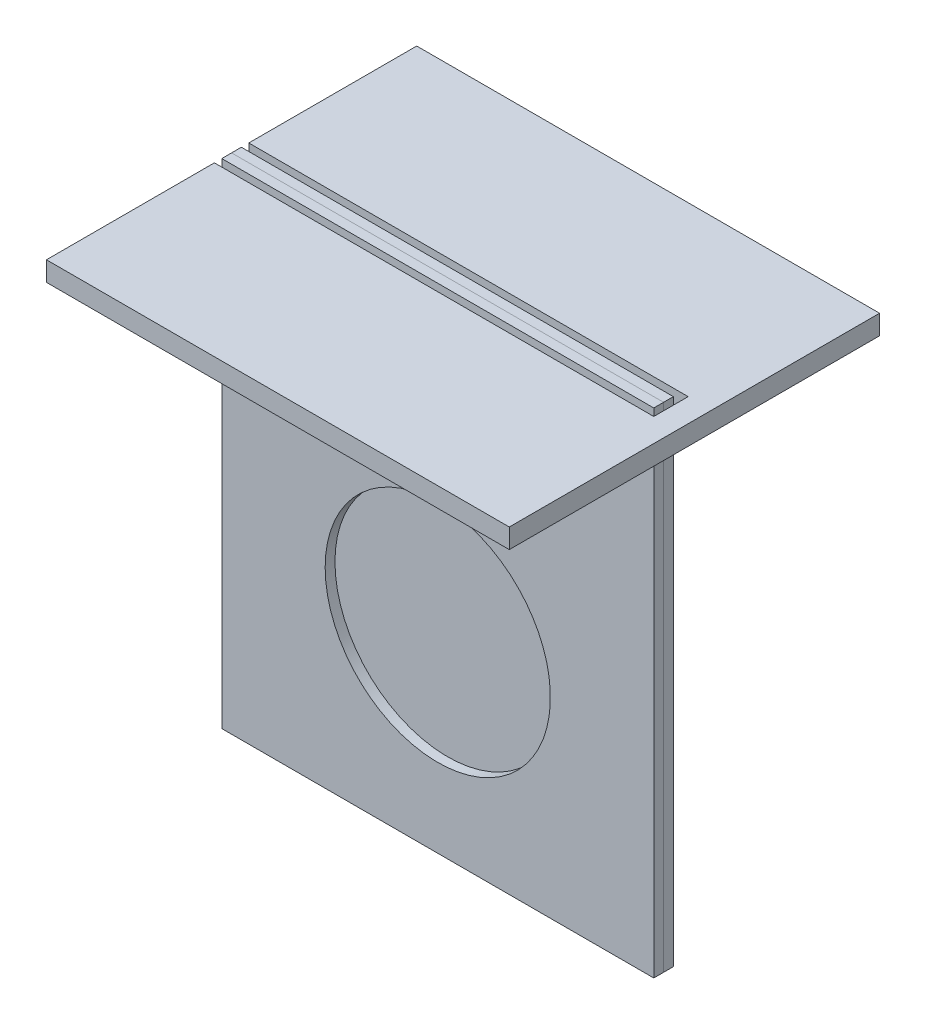
ISO-10303-21;
HEADER;
FILE_DESCRIPTION(('STEP AP214'),'2;1');
FILE_NAME('part.step','',(''),(''),'','','');
FILE_SCHEMA(('AUTOMOTIVE_DESIGN { 1 0 10303 214 1 1 1 1 }'));
ENDSEC;
DATA;
#1=APPLICATION_CONTEXT('core data for automotive mechanical design processes');
#2=APPLICATION_PROTOCOL_DEFINITION('international standard','automotive_design',2000,#1);
#3=PRODUCT_CONTEXT('',#1,'mechanical');
#4=PRODUCT('Part','Part','',(#3));
#5=PRODUCT_RELATED_PRODUCT_CATEGORY('part','',(#4));
#6=PRODUCT_DEFINITION_FORMATION('','',#4);
#7=PRODUCT_DEFINITION_CONTEXT('part definition',#1,'design');
#8=PRODUCT_DEFINITION('design','',#6,#7);
#9=PRODUCT_DEFINITION_SHAPE('','',#8);
#10=(LENGTH_UNIT() NAMED_UNIT(*) SI_UNIT(.MILLI.,.METRE.));
#11=(NAMED_UNIT(*) PLANE_ANGLE_UNIT() SI_UNIT($,.RADIAN.));
#12=(NAMED_UNIT(*) SI_UNIT($,.STERADIAN.) SOLID_ANGLE_UNIT());
#13=UNCERTAINTY_MEASURE_WITH_UNIT(LENGTH_MEASURE(1.E-05),#10,'distance_accuracy_value','');
#14=(GEOMETRIC_REPRESENTATION_CONTEXT(3) GLOBAL_UNCERTAINTY_ASSIGNED_CONTEXT((#13)) GLOBAL_UNIT_ASSIGNED_CONTEXT((#10,
#11,#12)) REPRESENTATION_CONTEXT('',''));
#15=CARTESIAN_POINT('',(0.,0.,0.));
#16=DIRECTION('',(0.,0.,1.));
#17=DIRECTION('',(1.,0.,0.));
#18=AXIS2_PLACEMENT_3D('',#15,#16,#17);
#19=CARTESIAN_POINT('',(-0.79375,45.825,-1.5875));
#20=DIRECTION('',(0.,-1.,0.));
#21=DIRECTION('',(0.,0.,1.));
#22=AXIS2_PLACEMENT_3D('',#19,#20,#21);
#23=PLANE('',#22);
#24=DIRECTION('',(0.,0.,1.));
#25=VECTOR('',#24,1.);
#26=CARTESIAN_POINT('',(0.79375,45.825,-1.5875));
#27=LINE('',#26,#25);
#28=CARTESIAN_POINT('',(0.79375,45.825,-30.));
#29=VERTEX_POINT('',#28);
#30=CARTESIAN_POINT('',(0.79375,45.825,-1.5875));
#31=VERTEX_POINT('',#30);
#32=EDGE_CURVE('E104',#29,#31,#27,.T.);
#33=ORIENTED_EDGE('',*,*,#32,.F.);
#34=DIRECTION('',(1.,0.,0.));
#35=VECTOR('',#34,1.);
#36=CARTESIAN_POINT('',(-0.79375,45.825,-30.));
#37=LINE('',#36,#35);
#38=CARTESIAN_POINT('',(-0.79375,45.825,-30.));
#39=VERTEX_POINT('',#38);
#40=EDGE_CURVE('E99',#39,#29,#37,.T.);
#41=ORIENTED_EDGE('',*,*,#40,.F.);
#42=DIRECTION('',(0.,0.,1.));
#43=VECTOR('',#42,1.);
#44=CARTESIAN_POINT('',(-0.79375,45.825,-1.5875));
#45=LINE('',#44,#43);
#46=CARTESIAN_POINT('',(-0.79375,45.825,-1.5875));
#47=VERTEX_POINT('',#46);
#48=EDGE_CURVE('E91',#39,#47,#45,.T.);
#49=ORIENTED_EDGE('',*,*,#48,.T.);
#50=DIRECTION('',(1.,0.,0.));
#51=VECTOR('',#50,1.);
#52=CARTESIAN_POINT('',(-0.79375,45.825,-1.5875));
#53=LINE('',#52,#51);
#54=EDGE_CURVE('E12',#47,#31,#53,.T.);
#55=ORIENTED_EDGE('',*,*,#54,.T.);
#56=EDGE_LOOP('',(#33,#41,#49,#55));
#57=FACE_BOUND('',#56,.T.);
#58=ADVANCED_FACE('F52',(#57),#23,.F.);
#59=CARTESIAN_POINT('',(-0.79375,16.9341740766103,-1.5875));
#60=DIRECTION('',(0.,0.,-1.));
#61=DIRECTION('',(0.,-1.,0.));
#62=AXIS2_PLACEMENT_3D('',#59,#60,#61);
#63=PLANE('',#62);
#64=DIRECTION('',(0.,-1.,0.));
#65=VECTOR('',#64,1.);
#66=CARTESIAN_POINT('',(0.79375,16.9341740766103,-1.5875));
#67=LINE('',#66,#65);
#68=CARTESIAN_POINT('',(0.79375,16.9341740766103,-1.5875));
#69=VERTEX_POINT('',#68);
#70=EDGE_CURVE('E96',#31,#69,#67,.T.);
#71=ORIENTED_EDGE('',*,*,#70,.F.);
#72=ORIENTED_EDGE('',*,*,#54,.F.);
#73=DIRECTION('',(0.,-1.,0.));
#74=VECTOR('',#73,1.);
#75=CARTESIAN_POINT('',(-0.79375,16.9341740766103,-1.5875));
#76=LINE('',#75,#74);
#77=CARTESIAN_POINT('',(-0.79375,16.9341740766103,-1.5875));
#78=VERTEX_POINT('',#77);
#79=EDGE_CURVE('E87',#47,#78,#76,.T.);
#80=ORIENTED_EDGE('',*,*,#79,.T.);
#81=DIRECTION('',(1.,0.,0.));
#82=VECTOR('',#81,1.);
#83=CARTESIAN_POINT('',(-0.79375,16.9341740766103,-1.5875));
#84=LINE('',#83,#82);
#85=EDGE_CURVE('E60',#78,#69,#84,.T.);
#86=ORIENTED_EDGE('',*,*,#85,.T.);
#87=EDGE_LOOP('',(#71,#72,#80,#86));
#88=FACE_BOUND('',#87,.T.);
#89=ADVANCED_FACE('F95',(#88),#63,.F.);
#90=CARTESIAN_POINT('',(-0.79375,45.825,-30.));
#91=DIRECTION('',(0.,0.701179947463391,0.712984348548575));
#92=DIRECTION('',(0.,0.712984348548575,-0.701179947463391));
#93=AXIS2_PLACEMENT_3D('',#90,#91,#92);
#94=PLANE('',#93);
#95=DIRECTION('',(0.,0.712984348548575,-0.701179947463391));
#96=VECTOR('',#95,1.);
#97=CARTESIAN_POINT('',(0.79375,45.825,-30.));
#98=LINE('',#97,#96);
#99=EDGE_CURVE('E79',#69,#29,#98,.T.);
#100=ORIENTED_EDGE('',*,*,#99,.F.);
#101=ORIENTED_EDGE('',*,*,#85,.F.);
#102=DIRECTION('',(0.,0.712984348548575,-0.701179947463391));
#103=VECTOR('',#102,1.);
#104=CARTESIAN_POINT('',(-0.79375,45.825,-30.));
#105=LINE('',#104,#103);
#106=EDGE_CURVE('E68',#78,#39,#105,.T.);
#107=ORIENTED_EDGE('',*,*,#106,.T.);
#108=ORIENTED_EDGE('',*,*,#40,.T.);
#109=EDGE_LOOP('',(#100,#101,#107,#108));
#110=FACE_BOUND('',#109,.T.);
#111=ADVANCED_FACE('F113',(#110),#94,.F.);
#112=CARTESIAN_POINT('',(-0.79375,0.,0.));
#113=DIRECTION('',(-1.,0.,0.));
#114=DIRECTION('',(0.,0.,-1.));
#115=AXIS2_PLACEMENT_3D('',#112,#113,#114);
#116=PLANE('',#115);
#117=ORIENTED_EDGE('',*,*,#48,.F.);
#118=ORIENTED_EDGE('',*,*,#106,.F.);
#119=ORIENTED_EDGE('',*,*,#79,.F.);
#120=EDGE_LOOP('',(#117,#118,#119));
#121=FACE_BOUND('',#120,.T.);
#122=ADVANCED_FACE('F89',(#121),#116,.T.);
#123=CARTESIAN_POINT('',(0.79375,0.,0.));
#124=DIRECTION('',(-1.,0.,0.));
#125=DIRECTION('',(0.,0.,-1.));
#126=AXIS2_PLACEMENT_3D('',#123,#124,#125);
#127=PLANE('',#126);
#128=ORIENTED_EDGE('',*,*,#32,.T.);
#129=ORIENTED_EDGE('',*,*,#70,.T.);
#130=ORIENTED_EDGE('',*,*,#99,.T.);
#131=EDGE_LOOP('',(#128,#129,#130));
#132=FACE_BOUND('',#131,.T.);
#133=ADVANCED_FACE('F107',(#132),#127,.F.);
#134=CLOSED_SHELL('',(#58,#89,#111,#122,#133));
#135=MANIFOLD_SOLID_BREP('B2',#134);
#136=CARTESIAN_POINT('',(-35.,45.825,-30.));
#137=DIRECTION('',(1.,0.,0.));
#138=DIRECTION('',(0.,0.,1.));
#139=AXIS2_PLACEMENT_3D('',#136,#137,#138);
#140=PLANE('',#139);
#141=DIRECTION('',(0.,0.,1.));
#142=VECTOR('',#141,1.);
#143=CARTESIAN_POINT('',(-35.,49.,-30.));
#144=LINE('',#143,#142);
#145=CARTESIAN_POINT('',(-35.,49.,-30.));
#146=VERTEX_POINT('',#145);
#147=CARTESIAN_POINT('',(-35.,49.,-2.7875));
#148=VERTEX_POINT('',#147);
#149=EDGE_CURVE('E266',#146,#148,#144,.T.);
#150=ORIENTED_EDGE('',*,*,#149,.F.);
#151=DIRECTION('',(0.,1.,0.));
#152=VECTOR('',#151,1.);
#153=CARTESIAN_POINT('',(-35.,45.825,-30.));
#154=LINE('',#153,#152);
#155=CARTESIAN_POINT('',(-35.,45.825,-30.));
#156=VERTEX_POINT('',#155);
#157=EDGE_CURVE('E265',#156,#146,#154,.T.);
#158=ORIENTED_EDGE('',*,*,#157,.F.);
#159=DIRECTION('',(0.,0.,1.));
#160=VECTOR('',#159,1.);
#161=CARTESIAN_POINT('',(-35.,45.825,-30.));
#162=LINE('',#161,#160);
#163=CARTESIAN_POINT('',(-35.,45.825,-2.7875));
#164=VERTEX_POINT('',#163);
#165=EDGE_CURVE('E284',#156,#164,#162,.T.);
#166=ORIENTED_EDGE('',*,*,#165,.T.);
#167=DIRECTION('',(0.,1.,0.));
#168=VECTOR('',#167,1.);
#169=CARTESIAN_POINT('',(-35.,45.825,-2.7875));
#170=LINE('',#169,#168);
#171=EDGE_CURVE('E50',#164,#148,#170,.T.);
#172=ORIENTED_EDGE('',*,*,#171,.T.);
#173=EDGE_LOOP('',(#150,#158,#166,#172));
#174=FACE_BOUND('',#173,.T.);
#175=ADVANCED_FACE('F170',(#174),#140,.F.);
#176=CARTESIAN_POINT('',(-35.,45.825,-2.7875));
#177=DIRECTION('',(0.,0.,-1.));
#178=DIRECTION('',(0.,-1.,0.));
#179=AXIS2_PLACEMENT_3D('',#176,#177,#178);
#180=PLANE('',#179);
#181=DIRECTION('',(1.,0.,0.));
#182=VECTOR('',#181,1.);
#183=CARTESIAN_POINT('',(-35.,49.,-2.7875));
#184=LINE('',#183,#182);
#185=CARTESIAN_POINT('',(36.2,49.,-2.7875));
#186=VERTEX_POINT('',#185);
#187=EDGE_CURVE('E268',#148,#186,#184,.T.);
#188=ORIENTED_EDGE('',*,*,#187,.F.);
#189=ORIENTED_EDGE('',*,*,#171,.F.);
#190=DIRECTION('',(1.,0.,0.));
#191=VECTOR('',#190,1.);
#192=CARTESIAN_POINT('',(-35.,45.825,-2.7875));
#193=LINE('',#192,#191);
#194=CARTESIAN_POINT('',(36.2,45.825,-2.7875));
#195=VERTEX_POINT('',#194);
#196=EDGE_CURVE('E224',#164,#195,#193,.T.);
#197=ORIENTED_EDGE('',*,*,#196,.T.);
#198=DIRECTION('',(0.,1.,0.));
#199=VECTOR('',#198,1.);
#200=CARTESIAN_POINT('',(36.2,45.825,-2.7875));
#201=LINE('',#200,#199);
#202=EDGE_CURVE('E178',#195,#186,#201,.T.);
#203=ORIENTED_EDGE('',*,*,#202,.T.);
#204=EDGE_LOOP('',(#188,#189,#197,#203));
#205=FACE_BOUND('',#204,.T.);
#206=ADVANCED_FACE('F296',(#205),#180,.F.);
#207=CARTESIAN_POINT('',(36.2,45.825,0.));
#208=DIRECTION('',(1.,0.,0.));
#209=DIRECTION('',(0.,1.,0.));
#210=AXIS2_PLACEMENT_3D('',#207,#208,#209);
#211=PLANE('',#210);
#212=DIRECTION('',(0.,0.,1.));
#213=VECTOR('',#212,1.);
#214=CARTESIAN_POINT('',(36.2,49.,0.));
#215=LINE('',#214,#213);
#216=CARTESIAN_POINT('',(36.2,49.,2.7875));
#217=VERTEX_POINT('',#216);
#218=EDGE_CURVE('E271',#186,#217,#215,.T.);
#219=ORIENTED_EDGE('',*,*,#218,.F.);
#220=ORIENTED_EDGE('',*,*,#202,.F.);
#221=DIRECTION('',(0.,0.,1.));
#222=VECTOR('',#221,1.);
#223=CARTESIAN_POINT('',(36.2,45.825,-2.7875));
#224=LINE('',#223,#222);
#225=CARTESIAN_POINT('',(36.2,45.825,2.7875));
#226=VERTEX_POINT('',#225);
#227=EDGE_CURVE('E305',#195,#226,#224,.T.);
#228=ORIENTED_EDGE('',*,*,#227,.T.);
#229=DIRECTION('',(0.,1.,0.));
#230=VECTOR('',#229,1.);
#231=CARTESIAN_POINT('',(36.2,45.825,2.7875));
#232=LINE('',#231,#230);
#233=EDGE_CURVE('E291',#226,#217,#232,.T.);
#234=ORIENTED_EDGE('',*,*,#233,.T.);
#235=EDGE_LOOP('',(#219,#220,#228,#234));
#236=FACE_BOUND('',#235,.T.);
#237=ADVANCED_FACE('F315',(#236),#211,.F.);
#238=CARTESIAN_POINT('',(36.2,45.825,2.7875));
#239=DIRECTION('',(0.,0.,1.));
#240=DIRECTION('',(0.,1.,0.));
#241=AXIS2_PLACEMENT_3D('',#238,#239,#240);
#242=PLANE('',#241);
#243=DIRECTION('',(-1.,0.,0.));
#244=VECTOR('',#243,1.);
#245=CARTESIAN_POINT('',(36.2,49.,2.7875));
#246=LINE('',#245,#244);
#247=CARTESIAN_POINT('',(-35.,49.,2.7875));
#248=VERTEX_POINT('',#247);
#249=EDGE_CURVE('E274',#217,#248,#246,.T.);
#250=ORIENTED_EDGE('',*,*,#249,.F.);
#251=ORIENTED_EDGE('',*,*,#233,.F.);
#252=DIRECTION('',(-1.,0.,0.));
#253=VECTOR('',#252,1.);
#254=CARTESIAN_POINT('',(36.2,45.825,2.7875));
#255=LINE('',#254,#253);
#256=CARTESIAN_POINT('',(-35.,45.825,2.7875));
#257=VERTEX_POINT('',#256);
#258=EDGE_CURVE('E260',#226,#257,#255,.T.);
#259=ORIENTED_EDGE('',*,*,#258,.T.);
#260=DIRECTION('',(0.,1.,0.));
#261=VECTOR('',#260,1.);
#262=CARTESIAN_POINT('',(-35.,45.825,2.7875));
#263=LINE('',#262,#261);
#264=EDGE_CURVE('E288',#257,#248,#263,.T.);
#265=ORIENTED_EDGE('',*,*,#264,.T.);
#266=EDGE_LOOP('',(#250,#251,#259,#265));
#267=FACE_BOUND('',#266,.T.);
#268=ADVANCED_FACE('F311',(#267),#242,.F.);
#269=CARTESIAN_POINT('',(-35.,45.825,2.7875));
#270=DIRECTION('',(1.,0.,0.));
#271=DIRECTION('',(0.,0.,1.));
#272=AXIS2_PLACEMENT_3D('',#269,#270,#271);
#273=PLANE('',#272);
#274=DIRECTION('',(0.,0.,1.));
#275=VECTOR('',#274,1.);
#276=CARTESIAN_POINT('',(-35.,49.,2.7875));
#277=LINE('',#276,#275);
#278=CARTESIAN_POINT('',(-35.,49.,30.));
#279=VERTEX_POINT('',#278);
#280=EDGE_CURVE('E277',#248,#279,#277,.T.);
#281=ORIENTED_EDGE('',*,*,#280,.F.);
#282=ORIENTED_EDGE('',*,*,#264,.F.);
#283=DIRECTION('',(0.,0.,1.));
#284=VECTOR('',#283,1.);
#285=CARTESIAN_POINT('',(-35.,45.825,2.7875));
#286=LINE('',#285,#284);
#287=CARTESIAN_POINT('',(-35.,45.825,30.));
#288=VERTEX_POINT('',#287);
#289=EDGE_CURVE('E258',#257,#288,#286,.T.);
#290=ORIENTED_EDGE('',*,*,#289,.T.);
#291=DIRECTION('',(0.,1.,0.));
#292=VECTOR('',#291,1.);
#293=CARTESIAN_POINT('',(-35.,45.825,30.));
#294=LINE('',#293,#292);
#295=EDGE_CURVE('E252',#288,#279,#294,.T.);
#296=ORIENTED_EDGE('',*,*,#295,.T.);
#297=EDGE_LOOP('',(#281,#282,#290,#296));
#298=FACE_BOUND('',#297,.T.);
#299=ADVANCED_FACE('F314',(#298),#273,.F.);
#300=CARTESIAN_POINT('',(-35.,45.825,30.));
#301=DIRECTION('',(0.,0.,-1.));
#302=DIRECTION('',(1.,0.,0.));
#303=AXIS2_PLACEMENT_3D('',#300,#301,#302);
#304=PLANE('',#303);
#305=DIRECTION('',(1.,0.,0.));
#306=VECTOR('',#305,1.);
#307=CARTESIAN_POINT('',(-35.,49.,30.));
#308=LINE('',#307,#306);
#309=CARTESIAN_POINT('',(40.,49.,30.));
#310=VERTEX_POINT('',#309);
#311=EDGE_CURVE('E280',#279,#310,#308,.T.);
#312=ORIENTED_EDGE('',*,*,#311,.F.);
#313=ORIENTED_EDGE('',*,*,#295,.F.);
#314=DIRECTION('',(1.,0.,0.));
#315=VECTOR('',#314,1.);
#316=CARTESIAN_POINT('',(-35.,45.825,30.));
#317=LINE('',#316,#315);
#318=CARTESIAN_POINT('',(40.,45.825,30.));
#319=VERTEX_POINT('',#318);
#320=EDGE_CURVE('E242',#288,#319,#317,.T.);
#321=ORIENTED_EDGE('',*,*,#320,.T.);
#322=DIRECTION('',(0.,1.,0.));
#323=VECTOR('',#322,1.);
#324=CARTESIAN_POINT('',(40.,45.825,30.));
#325=LINE('',#324,#323);
#326=EDGE_CURVE('E247',#319,#310,#325,.T.);
#327=ORIENTED_EDGE('',*,*,#326,.T.);
#328=EDGE_LOOP('',(#312,#313,#321,#327));
#329=FACE_BOUND('',#328,.T.);
#330=ADVANCED_FACE('F255',(#329),#304,.F.);
#331=CARTESIAN_POINT('',(40.,45.825,-30.));
#332=DIRECTION('',(-1.,0.,0.));
#333=DIRECTION('',(0.,-1.,0.));
#334=AXIS2_PLACEMENT_3D('',#331,#332,#333);
#335=PLANE('',#334);
#336=DIRECTION('',(0.,0.,-1.));
#337=VECTOR('',#336,1.);
#338=CARTESIAN_POINT('',(40.,49.,-30.));
#339=LINE('',#338,#337);
#340=CARTESIAN_POINT('',(40.,49.,-30.));
#341=VERTEX_POINT('',#340);
#342=EDGE_CURVE('E249',#310,#341,#339,.T.);
#343=ORIENTED_EDGE('',*,*,#342,.F.);
#344=ORIENTED_EDGE('',*,*,#326,.F.);
#345=DIRECTION('',(0.,0.,-1.));
#346=VECTOR('',#345,1.);
#347=CARTESIAN_POINT('',(40.,45.825,-30.));
#348=LINE('',#347,#346);
#349=CARTESIAN_POINT('',(40.,45.825,-30.));
#350=VERTEX_POINT('',#349);
#351=EDGE_CURVE('E238',#319,#350,#348,.T.);
#352=ORIENTED_EDGE('',*,*,#351,.T.);
#353=DIRECTION('',(0.,1.,0.));
#354=VECTOR('',#353,1.);
#355=CARTESIAN_POINT('',(40.,45.825,-30.));
#356=LINE('',#355,#354);
#357=EDGE_CURVE('E253',#350,#341,#356,.T.);
#358=ORIENTED_EDGE('',*,*,#357,.T.);
#359=EDGE_LOOP('',(#343,#344,#352,#358));
#360=FACE_BOUND('',#359,.T.);
#361=ADVANCED_FACE('F248',(#360),#335,.F.);
#362=CARTESIAN_POINT('',(-35.,45.825,-30.));
#363=DIRECTION('',(0.,0.,1.));
#364=DIRECTION('',(-1.,0.,0.));
#365=AXIS2_PLACEMENT_3D('',#362,#363,#364);
#366=PLANE('',#365);
#367=DIRECTION('',(-1.,0.,0.));
#368=VECTOR('',#367,1.);
#369=CARTESIAN_POINT('',(-35.,49.,-30.));
#370=LINE('',#369,#368);
#371=EDGE_CURVE('E212',#341,#146,#370,.T.);
#372=ORIENTED_EDGE('',*,*,#371,.F.);
#373=ORIENTED_EDGE('',*,*,#357,.F.);
#374=DIRECTION('',(-1.,0.,0.));
#375=VECTOR('',#374,1.);
#376=CARTESIAN_POINT('',(-35.,45.825,-30.));
#377=LINE('',#376,#375);
#378=EDGE_CURVE('E186',#350,#156,#377,.T.);
#379=ORIENTED_EDGE('',*,*,#378,.T.);
#380=ORIENTED_EDGE('',*,*,#157,.T.);
#381=EDGE_LOOP('',(#372,#373,#379,#380));
#382=FACE_BOUND('',#381,.T.);
#383=ADVANCED_FACE('F370',(#382),#366,.F.);
#384=CARTESIAN_POINT('',(0.,45.825,0.));
#385=DIRECTION('',(0.,-1.,0.));
#386=DIRECTION('',(0.,0.,1.));
#387=AXIS2_PLACEMENT_3D('',#384,#385,#386);
#388=PLANE('',#387);
#389=ORIENTED_EDGE('',*,*,#165,.F.);
#390=ORIENTED_EDGE('',*,*,#378,.F.);
#391=ORIENTED_EDGE('',*,*,#351,.F.);
#392=ORIENTED_EDGE('',*,*,#320,.F.);
#393=ORIENTED_EDGE('',*,*,#289,.F.);
#394=ORIENTED_EDGE('',*,*,#258,.F.);
#395=ORIENTED_EDGE('',*,*,#227,.F.);
#396=ORIENTED_EDGE('',*,*,#196,.F.);
#397=EDGE_LOOP('',(#389,#390,#391,#392,#393,#394,#395,#396));
#398=FACE_BOUND('',#397,.T.);
#399=ADVANCED_FACE('F240',(#398),#388,.T.);
#400=CARTESIAN_POINT('',(0.,49.,0.));
#401=DIRECTION('',(0.,-1.,0.));
#402=DIRECTION('',(0.,0.,1.));
#403=AXIS2_PLACEMENT_3D('',#400,#401,#402);
#404=PLANE('',#403);
#405=ORIENTED_EDGE('',*,*,#149,.T.);
#406=ORIENTED_EDGE('',*,*,#187,.T.);
#407=ORIENTED_EDGE('',*,*,#218,.T.);
#408=ORIENTED_EDGE('',*,*,#249,.T.);
#409=ORIENTED_EDGE('',*,*,#280,.T.);
#410=ORIENTED_EDGE('',*,*,#311,.T.);
#411=ORIENTED_EDGE('',*,*,#342,.T.);
#412=ORIENTED_EDGE('',*,*,#371,.T.);
#413=EDGE_LOOP('',(#405,#406,#407,#408,#409,#410,#411,#412));
#414=FACE_BOUND('',#413,.T.);
#415=ADVANCED_FACE('F299',(#414),#404,.F.);
#416=CLOSED_SHELL('',(#175,#206,#237,#268,#299,#330,#361,#383,#399,#415));
#417=MANIFOLD_SOLID_BREP('B6',#416);
#418=CARTESIAN_POINT('',(0.,0.,1.5875));
#419=DIRECTION('',(0.,0.,1.));
#420=DIRECTION('',(-1.,0.,0.));
#421=AXIS2_PLACEMENT_3D('',#418,#419,#420);
#422=PLANE('',#421);
#423=DIRECTION('',(1.,0.,0.));
#424=VECTOR('',#423,1.);
#425=CARTESIAN_POINT('',(-35.,49.,1.5875));
#426=LINE('',#425,#424);
#427=CARTESIAN_POINT('',(-35.,49.,1.5875));
#428=VERTEX_POINT('',#427);
#429=CARTESIAN_POINT('',(35.,49.,1.5875));
#430=VERTEX_POINT('',#429);
#431=EDGE_CURVE('E486',#428,#430,#426,.T.);
#432=ORIENTED_EDGE('',*,*,#431,.F.);
#433=DIRECTION('',(0.,1.,0.));
#434=VECTOR('',#433,1.);
#435=CARTESIAN_POINT('',(-35.,-31.,1.5875));
#436=LINE('',#435,#434);
#437=CARTESIAN_POINT('',(-35.,-31.,1.5875));
#438=VERTEX_POINT('',#437);
#439=EDGE_CURVE('E489',#438,#428,#436,.T.);
#440=ORIENTED_EDGE('',*,*,#439,.F.);
#441=DIRECTION('',(-1.,0.,0.));
#442=VECTOR('',#441,1.);
#443=CARTESIAN_POINT('',(35.,-31.,1.5875));
#444=LINE('',#443,#442);
#445=CARTESIAN_POINT('',(35.,-31.,1.5875));
#446=VERTEX_POINT('',#445);
#447=EDGE_CURVE('E477',#446,#438,#444,.T.);
#448=ORIENTED_EDGE('',*,*,#447,.F.);
#449=DIRECTION('',(0.,-1.,0.));
#450=VECTOR('',#449,1.);
#451=CARTESIAN_POINT('',(35.,49.,1.5875));
#452=LINE('',#451,#450);
#453=EDGE_CURVE('E482',#430,#446,#452,.T.);
#454=ORIENTED_EDGE('',*,*,#453,.F.);
#455=EDGE_LOOP('',(#432,#440,#448,#454));
#456=FACE_BOUND('',#455,.T.);
#457=CARTESIAN_POINT('',(0.,0.,1.5875));
#458=DIRECTION('',(0.,0.,-1.));
#459=DIRECTION('',(-1.,0.,0.));
#460=AXIS2_PLACEMENT_3D('',#457,#458,#459);
#461=CIRCLE('',#460,18.2500000000008);
#462=CARTESIAN_POINT('',(-18.2500000000008,0.,1.5875));
#463=VERTEX_POINT('',#462);
#464=EDGE_CURVE('E498',#463,#463,#461,.T.);
#465=ORIENTED_EDGE('',*,*,#464,.T.);
#466=EDGE_LOOP('',(#465));
#467=FACE_BOUND('',#466,.T.);
#468=ADVANCED_FACE('F430',(#456,#467),#422,.T.);
#469=CARTESIAN_POINT('',(0.,0.,0.));
#470=DIRECTION('',(0.,0.,1.));
#471=DIRECTION('',(-1.,0.,0.));
#472=AXIS2_PLACEMENT_3D('',#469,#470,#471);
#473=PLANE('',#472);
#474=DIRECTION('',(1.,0.,0.));
#475=VECTOR('',#474,1.);
#476=CARTESIAN_POINT('',(-35.,49.,0.));
#477=LINE('',#476,#475);
#478=CARTESIAN_POINT('',(-35.,49.,0.));
#479=VERTEX_POINT('',#478);
#480=CARTESIAN_POINT('',(35.,49.,0.));
#481=VERTEX_POINT('',#480);
#482=EDGE_CURVE('E494',#479,#481,#477,.T.);
#483=ORIENTED_EDGE('',*,*,#482,.T.);
#484=DIRECTION('',(0.,-1.,0.));
#485=VECTOR('',#484,1.);
#486=CARTESIAN_POINT('',(35.,49.,0.));
#487=LINE('',#486,#485);
#488=CARTESIAN_POINT('',(35.,-31.,0.));
#489=VERTEX_POINT('',#488);
#490=EDGE_CURVE('E497',#481,#489,#487,.T.);
#491=ORIENTED_EDGE('',*,*,#490,.T.);
#492=DIRECTION('',(-1.,0.,0.));
#493=VECTOR('',#492,1.);
#494=CARTESIAN_POINT('',(35.,-31.,0.));
#495=LINE('',#494,#493);
#496=CARTESIAN_POINT('',(-35.,-31.,0.));
#497=VERTEX_POINT('',#496);
#498=EDGE_CURVE('E480',#489,#497,#495,.T.);
#499=ORIENTED_EDGE('',*,*,#498,.T.);
#500=DIRECTION('',(0.,1.,0.));
#501=VECTOR('',#500,1.);
#502=CARTESIAN_POINT('',(-35.,-31.,0.));
#503=LINE('',#502,#501);
#504=EDGE_CURVE('E501',#497,#479,#503,.T.);
#505=ORIENTED_EDGE('',*,*,#504,.T.);
#506=EDGE_LOOP('',(#483,#491,#499,#505));
#507=FACE_BOUND('',#506,.T.);
#508=CARTESIAN_POINT('',(0.,0.,0.));
#509=DIRECTION('',(0.,0.,-1.));
#510=DIRECTION('',(-1.,0.,0.));
#511=AXIS2_PLACEMENT_3D('',#508,#509,#510);
#512=CIRCLE('',#511,18.2500000000008);
#513=CARTESIAN_POINT('',(-18.2500000000008,0.,0.));
#514=VERTEX_POINT('',#513);
#515=EDGE_CURVE('E506',#514,#514,#512,.T.);
#516=ORIENTED_EDGE('',*,*,#515,.F.);
#517=EDGE_LOOP('',(#516));
#518=FACE_BOUND('',#517,.T.);
#519=ADVANCED_FACE('F519',(#507,#518),#473,.F.);
#520=CARTESIAN_POINT('',(-35.,49.,1.5875));
#521=DIRECTION('',(0.,-1.,0.));
#522=DIRECTION('',(0.,0.,1.));
#523=AXIS2_PLACEMENT_3D('',#520,#521,#522);
#524=PLANE('',#523);
#525=ORIENTED_EDGE('',*,*,#482,.F.);
#526=DIRECTION('',(0.,0.,-1.));
#527=VECTOR('',#526,1.);
#528=CARTESIAN_POINT('',(-35.,49.,1.5875));
#529=LINE('',#528,#527);
#530=EDGE_CURVE('E447',#428,#479,#529,.T.);
#531=ORIENTED_EDGE('',*,*,#530,.F.);
#532=ORIENTED_EDGE('',*,*,#431,.T.);
#533=DIRECTION('',(0.,0.,-1.));
#534=VECTOR('',#533,1.);
#535=CARTESIAN_POINT('',(35.,49.,1.5875));
#536=LINE('',#535,#534);
#537=EDGE_CURVE('E168',#430,#481,#536,.T.);
#538=ORIENTED_EDGE('',*,*,#537,.T.);
#539=EDGE_LOOP('',(#525,#531,#532,#538));
#540=FACE_BOUND('',#539,.T.);
#541=ADVANCED_FACE('F432',(#540),#524,.F.);
#542=CARTESIAN_POINT('',(35.,49.,1.5875));
#543=DIRECTION('',(-1.,0.,0.));
#544=DIRECTION('',(0.,-1.,0.));
#545=AXIS2_PLACEMENT_3D('',#542,#543,#544);
#546=PLANE('',#545);
#547=ORIENTED_EDGE('',*,*,#490,.F.);
#548=ORIENTED_EDGE('',*,*,#537,.F.);
#549=ORIENTED_EDGE('',*,*,#453,.T.);
#550=DIRECTION('',(0.,0.,-1.));
#551=VECTOR('',#550,1.);
#552=CARTESIAN_POINT('',(35.,-31.,1.5875));
#553=LINE('',#552,#551);
#554=EDGE_CURVE('E439',#446,#489,#553,.T.);
#555=ORIENTED_EDGE('',*,*,#554,.T.);
#556=EDGE_LOOP('',(#547,#548,#549,#555));
#557=FACE_BOUND('',#556,.T.);
#558=ADVANCED_FACE('F483',(#557),#546,.F.);
#559=CARTESIAN_POINT('',(35.,-31.,1.5875));
#560=DIRECTION('',(0.,1.,0.));
#561=DIRECTION('',(0.,0.,-1.));
#562=AXIS2_PLACEMENT_3D('',#559,#560,#561);
#563=PLANE('',#562);
#564=ORIENTED_EDGE('',*,*,#498,.F.);
#565=ORIENTED_EDGE('',*,*,#554,.F.);
#566=ORIENTED_EDGE('',*,*,#447,.T.);
#567=DIRECTION('',(0.,0.,-1.));
#568=VECTOR('',#567,1.);
#569=CARTESIAN_POINT('',(-35.,-31.,1.5875));
#570=LINE('',#569,#568);
#571=EDGE_CURVE('E463',#438,#497,#570,.T.);
#572=ORIENTED_EDGE('',*,*,#571,.T.);
#573=EDGE_LOOP('',(#564,#565,#566,#572));
#574=FACE_BOUND('',#573,.T.);
#575=ADVANCED_FACE('F475',(#574),#563,.F.);
#576=CARTESIAN_POINT('',(-35.,-31.,1.5875));
#577=DIRECTION('',(1.,0.,0.));
#578=DIRECTION('',(0.,1.,0.));
#579=AXIS2_PLACEMENT_3D('',#576,#577,#578);
#580=PLANE('',#579);
#581=ORIENTED_EDGE('',*,*,#504,.F.);
#582=ORIENTED_EDGE('',*,*,#571,.F.);
#583=ORIENTED_EDGE('',*,*,#439,.T.);
#584=ORIENTED_EDGE('',*,*,#530,.T.);
#585=EDGE_LOOP('',(#581,#582,#583,#584));
#586=FACE_BOUND('',#585,.T.);
#587=ADVANCED_FACE('F515',(#586),#580,.F.);
#588=CARTESIAN_POINT('',(0.,0.,1.5875));
#589=DIRECTION('',(0.,0.,-1.));
#590=DIRECTION('',(1.,0.,0.));
#591=AXIS2_PLACEMENT_3D('',#588,#589,#590);
#592=CYLINDRICAL_SURFACE('',#591,18.2500000000008);
#593=ORIENTED_EDGE('',*,*,#464,.F.);
#594=EDGE_LOOP('',(#593));
#595=FACE_BOUND('',#594,.T.);
#596=ORIENTED_EDGE('',*,*,#515,.T.);
#597=EDGE_LOOP('',(#596));
#598=FACE_BOUND('',#597,.T.);
#599=ADVANCED_FACE('F512',(#595,#598),#592,.F.);
#600=CLOSED_SHELL('',(#468,#519,#541,#558,#575,#587,#599));
#601=MANIFOLD_SOLID_BREP('B44',#600);
#602=CARTESIAN_POINT('',(35.,-31.,-1.5875));
#603=DIRECTION('',(-1.,0.,0.));
#604=DIRECTION('',(0.,-1.,0.));
#605=AXIS2_PLACEMENT_3D('',#602,#603,#604);
#606=PLANE('',#605);
#607=DIRECTION('',(0.,1.,0.));
#608=VECTOR('',#607,1.);
#609=CARTESIAN_POINT('',(35.,-31.,0.));
#610=LINE('',#609,#608);
#611=CARTESIAN_POINT('',(35.,-31.,0.));
#612=VERTEX_POINT('',#611);
#613=CARTESIAN_POINT('',(35.,49.,0.));
#614=VERTEX_POINT('',#613);
#615=EDGE_CURVE('E652',#612,#614,#610,.T.);
#616=ORIENTED_EDGE('',*,*,#615,.F.);
#617=DIRECTION('',(0.,0.,1.));
#618=VECTOR('',#617,1.);
#619=CARTESIAN_POINT('',(35.,-31.,-1.5875));
#620=LINE('',#619,#618);
#621=CARTESIAN_POINT('',(35.,-31.,-1.5875));
#622=VERTEX_POINT('',#621);
#623=EDGE_CURVE('E651',#622,#612,#620,.T.);
#624=ORIENTED_EDGE('',*,*,#623,.F.);
#625=DIRECTION('',(0.,1.,0.));
#626=VECTOR('',#625,1.);
#627=CARTESIAN_POINT('',(35.,-31.,-1.5875));
#628=LINE('',#627,#626);
#629=CARTESIAN_POINT('',(35.,49.,-1.5875));
#630=VERTEX_POINT('',#629);
#631=EDGE_CURVE('E646',#622,#630,#628,.T.);
#632=ORIENTED_EDGE('',*,*,#631,.T.);
#633=DIRECTION('',(0.,0.,1.));
#634=VECTOR('',#633,1.);
#635=CARTESIAN_POINT('',(35.,49.,-1.5875));
#636=LINE('',#635,#634);
#637=EDGE_CURVE('E428',#630,#614,#636,.T.);
#638=ORIENTED_EDGE('',*,*,#637,.T.);
#639=EDGE_LOOP('',(#616,#624,#632,#638));
#640=FACE_BOUND('',#639,.T.);
#641=ADVANCED_FACE('F589',(#640),#606,.F.);
#642=CARTESIAN_POINT('',(35.,49.,-1.5875));
#643=DIRECTION('',(0.,-1.,0.));
#644=DIRECTION('',(0.,0.,1.));
#645=AXIS2_PLACEMENT_3D('',#642,#643,#644);
#646=PLANE('',#645);
#647=DIRECTION('',(-1.,0.,0.));
#648=VECTOR('',#647,1.);
#649=CARTESIAN_POINT('',(35.,49.,0.));
#650=LINE('',#649,#648);
#651=CARTESIAN_POINT('',(-35.,49.,0.));
#652=VERTEX_POINT('',#651);
#653=EDGE_CURVE('E654',#614,#652,#650,.T.);
#654=ORIENTED_EDGE('',*,*,#653,.F.);
#655=ORIENTED_EDGE('',*,*,#637,.F.);
#656=DIRECTION('',(-1.,0.,0.));
#657=VECTOR('',#656,1.);
#658=CARTESIAN_POINT('',(35.,49.,-1.5875));
#659=LINE('',#658,#657);
#660=CARTESIAN_POINT('',(-35.,49.,-1.5875));
#661=VERTEX_POINT('',#660);
#662=EDGE_CURVE('E630',#630,#661,#659,.T.);
#663=ORIENTED_EDGE('',*,*,#662,.T.);
#664=DIRECTION('',(0.,0.,1.));
#665=VECTOR('',#664,1.);
#666=CARTESIAN_POINT('',(-35.,49.,-1.5875));
#667=LINE('',#666,#665);
#668=EDGE_CURVE('E597',#661,#652,#667,.T.);
#669=ORIENTED_EDGE('',*,*,#668,.T.);
#670=EDGE_LOOP('',(#654,#655,#663,#669));
#671=FACE_BOUND('',#670,.T.);
#672=ADVANCED_FACE('F644',(#671),#646,.F.);
#673=CARTESIAN_POINT('',(-35.,-31.,-1.5875));
#674=DIRECTION('',(1.,0.,0.));
#675=DIRECTION('',(0.,1.,0.));
#676=AXIS2_PLACEMENT_3D('',#673,#674,#675);
#677=PLANE('',#676);
#678=DIRECTION('',(0.,-1.,0.));
#679=VECTOR('',#678,1.);
#680=CARTESIAN_POINT('',(-35.,-31.,0.));
#681=LINE('',#680,#679);
#682=CARTESIAN_POINT('',(-35.,-31.,0.));
#683=VERTEX_POINT('',#682);
#684=EDGE_CURVE('E640',#652,#683,#681,.T.);
#685=ORIENTED_EDGE('',*,*,#684,.F.);
#686=ORIENTED_EDGE('',*,*,#668,.F.);
#687=DIRECTION('',(0.,-1.,0.));
#688=VECTOR('',#687,1.);
#689=CARTESIAN_POINT('',(-35.,-31.,-1.5875));
#690=LINE('',#689,#688);
#691=CARTESIAN_POINT('',(-35.,-31.,-1.5875));
#692=VERTEX_POINT('',#691);
#693=EDGE_CURVE('E633',#661,#692,#690,.T.);
#694=ORIENTED_EDGE('',*,*,#693,.T.);
#695=DIRECTION('',(0.,0.,1.));
#696=VECTOR('',#695,1.);
#697=CARTESIAN_POINT('',(-35.,-31.,-1.5875));
#698=LINE('',#697,#696);
#699=EDGE_CURVE('E643',#692,#683,#698,.T.);
#700=ORIENTED_EDGE('',*,*,#699,.T.);
#701=EDGE_LOOP('',(#685,#686,#694,#700));
#702=FACE_BOUND('',#701,.T.);
#703=ADVANCED_FACE('F639',(#702),#677,.F.);
#704=CARTESIAN_POINT('',(35.,-31.,-1.5875));
#705=DIRECTION('',(0.,1.,0.));
#706=DIRECTION('',(0.,0.,-1.));
#707=AXIS2_PLACEMENT_3D('',#704,#705,#706);
#708=PLANE('',#707);
#709=DIRECTION('',(1.,0.,0.));
#710=VECTOR('',#709,1.);
#711=CARTESIAN_POINT('',(35.,-31.,0.));
#712=LINE('',#711,#710);
#713=EDGE_CURVE('E619',#683,#612,#712,.T.);
#714=ORIENTED_EDGE('',*,*,#713,.F.);
#715=ORIENTED_EDGE('',*,*,#699,.F.);
#716=DIRECTION('',(1.,0.,0.));
#717=VECTOR('',#716,1.);
#718=CARTESIAN_POINT('',(35.,-31.,-1.5875));
#719=LINE('',#718,#717);
#720=EDGE_CURVE('E605',#692,#622,#719,.T.);
#721=ORIENTED_EDGE('',*,*,#720,.T.);
#722=ORIENTED_EDGE('',*,*,#623,.T.);
#723=EDGE_LOOP('',(#714,#715,#721,#722));
#724=FACE_BOUND('',#723,.T.);
#725=ADVANCED_FACE('F663',(#724),#708,.F.);
#726=CARTESIAN_POINT('',(0.,0.,-1.5875));
#727=DIRECTION('',(0.,0.,-1.));
#728=DIRECTION('',(1.,0.,0.));
#729=AXIS2_PLACEMENT_3D('',#726,#727,#728);
#730=PLANE('',#729);
#731=ORIENTED_EDGE('',*,*,#631,.F.);
#732=ORIENTED_EDGE('',*,*,#720,.F.);
#733=ORIENTED_EDGE('',*,*,#693,.F.);
#734=ORIENTED_EDGE('',*,*,#662,.F.);
#735=EDGE_LOOP('',(#731,#732,#733,#734));
#736=FACE_BOUND('',#735,.T.);
#737=ADVANCED_FACE('F635',(#736),#730,.T.);
#738=CARTESIAN_POINT('',(0.,0.,0.));
#739=DIRECTION('',(0.,0.,-1.));
#740=DIRECTION('',(1.,0.,0.));
#741=AXIS2_PLACEMENT_3D('',#738,#739,#740);
#742=PLANE('',#741);
#743=ORIENTED_EDGE('',*,*,#615,.T.);
#744=ORIENTED_EDGE('',*,*,#653,.T.);
#745=ORIENTED_EDGE('',*,*,#684,.T.);
#746=ORIENTED_EDGE('',*,*,#713,.T.);
#747=EDGE_LOOP('',(#743,#744,#745,#746));
#748=FACE_BOUND('',#747,.T.);
#749=ADVANCED_FACE('F659',(#748),#742,.F.);
#750=CLOSED_SHELL('',(#641,#672,#703,#725,#737,#749));
#751=MANIFOLD_SOLID_BREP('B162',#750);
#752=ADVANCED_BREP_SHAPE_REPRESENTATION('',(#18,#135,#417,#601,#751),#14);
#753=SHAPE_DEFINITION_REPRESENTATION(#9,#752);
ENDSEC;
END-ISO-10303-21;
